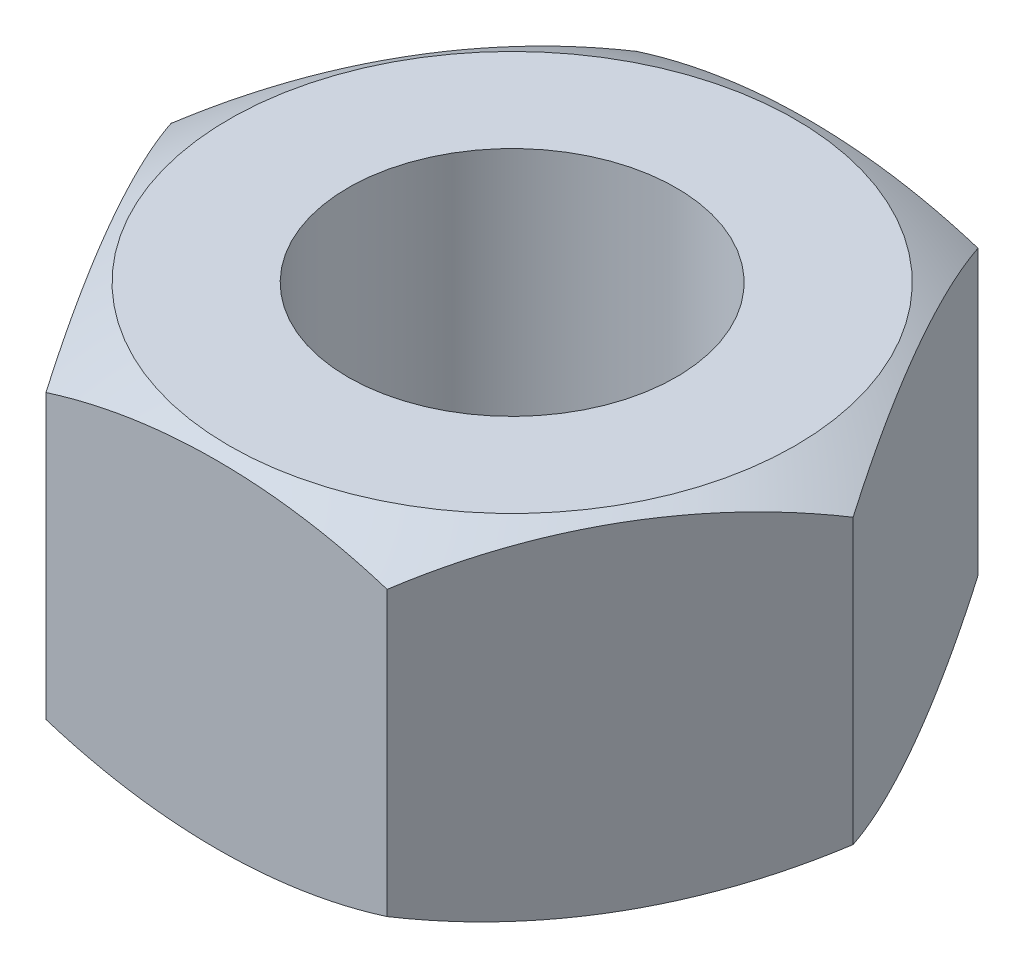
ISO-10303-21;
HEADER;
FILE_DESCRIPTION(('STEP AP214'),'2;1');
FILE_NAME('part.step','',(''),(''),'','','');
FILE_SCHEMA(('AUTOMOTIVE_DESIGN { 1 0 10303 214 1 1 1 1 }'));
ENDSEC;
DATA;
#1=APPLICATION_CONTEXT('core data for automotive mechanical design processes');
#2=APPLICATION_PROTOCOL_DEFINITION('international standard','automotive_design',2000,#1);
#3=PRODUCT_CONTEXT('',#1,'mechanical');
#4=PRODUCT('Part','Part','',(#3));
#5=PRODUCT_RELATED_PRODUCT_CATEGORY('part','',(#4));
#6=PRODUCT_DEFINITION_FORMATION('','',#4);
#7=PRODUCT_DEFINITION_CONTEXT('part definition',#1,'design');
#8=PRODUCT_DEFINITION('design','',#6,#7);
#9=PRODUCT_DEFINITION_SHAPE('','',#8);
#10=(LENGTH_UNIT() NAMED_UNIT(*) SI_UNIT(.MILLI.,.METRE.));
#11=(NAMED_UNIT(*) PLANE_ANGLE_UNIT() SI_UNIT($,.RADIAN.));
#12=(NAMED_UNIT(*) SI_UNIT($,.STERADIAN.) SOLID_ANGLE_UNIT());
#13=UNCERTAINTY_MEASURE_WITH_UNIT(LENGTH_MEASURE(1.E-05),#10,'distance_accuracy_value','');
#14=(GEOMETRIC_REPRESENTATION_CONTEXT(3) GLOBAL_UNCERTAINTY_ASSIGNED_CONTEXT((#13)) GLOBAL_UNIT_ASSIGNED_CONTEXT((#10,
#11,#12)) REPRESENTATION_CONTEXT('',''));
#15=CARTESIAN_POINT('',(0.,0.,0.));
#16=DIRECTION('',(0.,0.,1.));
#17=DIRECTION('',(1.,0.,0.));
#18=AXIS2_PLACEMENT_3D('',#15,#16,#17);
#19=CARTESIAN_POINT('',(-8.25989049367484,8.4455,-14.29385));
#20=DIRECTION('',(0.,0.,-1.));
#21=DIRECTION('',(-1.,0.,0.));
#22=AXIS2_PLACEMENT_3D('',#19,#20,#21);
#23=PLANE('',#22);
#24=DIRECTION('',(0.,-1.,0.));
#25=VECTOR('',#24,1.);
#26=CARTESIAN_POINT('',(8.2452257968374,8.4455,-14.29385));
#27=LINE('',#26,#25);
#28=CARTESIAN_POINT('',(8.2452257968374,6.85800000000003,-14.29385));
#29=VERTEX_POINT('',#28);
#30=CARTESIAN_POINT('',(8.2452257968374,-6.85800000000003,-14.29385));
#31=VERTEX_POINT('',#30);
#32=EDGE_CURVE('E252',#29,#31,#27,.T.);
#33=ORIENTED_EDGE('',*,*,#32,.T.);
#34=DIRECTION('',(-1.,0.,0.));
#35=VECTOR('',#34,1.);
#36=CARTESIAN_POINT('',(-8.25989049367482,-6.85800000000003,-14.29385));
#37=LINE('',#36,#35);
#38=CARTESIAN_POINT('',(8.23788365889581,-6.85800000000003,-14.29385));
#39=VERTEX_POINT('',#38);
#40=EDGE_CURVE('E59',#31,#39,#37,.T.);
#41=ORIENTED_EDGE('',*,*,#40,.T.);
#42=CARTESIAN_POINT('',(0.,19.05,-14.29385));
#43=DIRECTION('',(0.,0.,-1.));
#44=DIRECTION('',(-1.,0.,0.));
#45=AXIS2_PLACEMENT_3D('',#42,#43,#44);
#46=CIRCLE('',#45,27.186158080492);
#47=CARTESIAN_POINT('',(-8.23788365889583,-6.85800000000003,-14.29385));
#48=VERTEX_POINT('',#47);
#49=EDGE_CURVE('E203',#48,#39,#46,.F.);
#50=ORIENTED_EDGE('',*,*,#49,.F.);
#51=CARTESIAN_POINT('',(-8.25989049367483,-6.85800000000003,-14.29385));
#52=VERTEX_POINT('',#51);
#53=EDGE_CURVE('E197',#48,#52,#37,.T.);
#54=ORIENTED_EDGE('',*,*,#53,.T.);
#55=DIRECTION('',(0.,-1.,0.));
#56=VECTOR('',#55,1.);
#57=CARTESIAN_POINT('',(-8.25989049367484,8.4455,-14.29385));
#58=LINE('',#57,#56);
#59=CARTESIAN_POINT('',(-8.25989049367484,6.85800000000003,-14.29385));
#60=VERTEX_POINT('',#59);
#61=EDGE_CURVE('E255',#60,#52,#58,.T.);
#62=ORIENTED_EDGE('',*,*,#61,.F.);
#63=DIRECTION('',(1.,0.,0.));
#64=VECTOR('',#63,1.);
#65=CARTESIAN_POINT('',(-8.25989049367484,6.85800000000003,-14.29385));
#66=LINE('',#65,#64);
#67=CARTESIAN_POINT('',(-8.23788365889583,6.85800000000003,-14.29385));
#68=VERTEX_POINT('',#67);
#69=EDGE_CURVE('E219',#60,#68,#66,.T.);
#70=ORIENTED_EDGE('',*,*,#69,.T.);
#71=CARTESIAN_POINT('',(0.,-19.05,-14.29385));
#72=DIRECTION('',(0.,0.,-1.));
#73=DIRECTION('',(-1.,0.,0.));
#74=AXIS2_PLACEMENT_3D('',#71,#72,#73);
#75=CIRCLE('',#74,27.186158080492);
#76=CARTESIAN_POINT('',(8.2378836588958,6.85800000000003,-14.29385));
#77=VERTEX_POINT('',#76);
#78=EDGE_CURVE('E231',#77,#68,#75,.F.);
#79=ORIENTED_EDGE('',*,*,#78,.F.);
#80=EDGE_CURVE('E222',#77,#29,#66,.T.);
#81=ORIENTED_EDGE('',*,*,#80,.T.);
#82=EDGE_LOOP('',(#33,#41,#50,#54,#62,#70,#79,#81));
#83=FACE_BOUND('',#82,.T.);
#84=ADVANCED_FACE('F44',(#83),#23,.T.);
#85=CARTESIAN_POINT('',(-8.25989049367484,8.4455,-14.29385));
#86=DIRECTION('',(0.866025403784437,0.,0.500000000000005));
#87=DIRECTION('',(0.500000000000003,0.,-0.866025403784438));
#88=AXIS2_PLACEMENT_3D('',#85,#86,#87);
#89=PLANE('',#88);
#90=DIRECTION('',(0.500000000000003,0.,-0.866025403784438));
#91=VECTOR('',#90,1.);
#92=CARTESIAN_POINT('',(-8.25989049367482,-6.85800000000003,-14.29385));
#93=LINE('',#92,#91);
#94=CARTESIAN_POINT('',(-16.512448638931,-6.85800000000003,0.));
#95=VERTEX_POINT('',#94);
#96=CARTESIAN_POINT('',(-16.4977643368372,-6.85800000000003,-0.0254339573001861));
#97=VERTEX_POINT('',#96);
#98=EDGE_CURVE('E177',#95,#97,#93,.T.);
#99=ORIENTED_EDGE('',*,*,#98,.F.);
#100=DIRECTION('',(0.,-1.,0.));
#101=VECTOR('',#100,1.);
#102=CARTESIAN_POINT('',(-16.512448638931,8.4455,0.));
#103=LINE('',#102,#101);
#104=CARTESIAN_POINT('',(-16.512448638931,6.85800000000003,0.));
#105=VERTEX_POINT('',#104);
#106=EDGE_CURVE('E184',#105,#95,#103,.T.);
#107=ORIENTED_EDGE('',*,*,#106,.F.);
#108=DIRECTION('',(-0.500000000000003,0.,0.866025403784438));
#109=VECTOR('',#108,1.);
#110=CARTESIAN_POINT('',(-8.25989049367484,6.85800000000003,-14.29385));
#111=LINE('',#110,#109);
#112=CARTESIAN_POINT('',(-16.4977643368372,6.85800000000003,-0.0254339573001904));
#113=VERTEX_POINT('',#112);
#114=EDGE_CURVE('E216',#113,#105,#111,.T.);
#115=ORIENTED_EDGE('',*,*,#114,.F.);
#116=CARTESIAN_POINT('',(-12.3843364791982,-19.05,-7.15010000000006));
#117=DIRECTION('',(0.866025403784437,0.,0.500000000000005));
#118=DIRECTION('',(0.500000000000003,0.,-0.866025403784438));
#119=AXIS2_PLACEMENT_3D('',#116,#117,#118);
#120=CIRCLE('',#119,27.1828184513674);
#121=CARTESIAN_POINT('',(-8.27090862155921,6.85800000000003,-14.2747660427));
#122=VERTEX_POINT('',#121);
#123=EDGE_CURVE('E228',#113,#122,#120,.F.);
#124=ORIENTED_EDGE('',*,*,#123,.T.);
#125=EDGE_CURVE('E218',#60,#122,#111,.T.);
#126=ORIENTED_EDGE('',*,*,#125,.F.);
#127=ORIENTED_EDGE('',*,*,#61,.T.);
#128=CARTESIAN_POINT('',(-8.2709086215592,-6.85800000000003,-14.2747660427));
#129=VERTEX_POINT('',#128);
#130=EDGE_CURVE('E187',#129,#52,#93,.T.);
#131=ORIENTED_EDGE('',*,*,#130,.F.);
#132=CARTESIAN_POINT('',(-12.3843364791982,19.05,-7.1501000000001));
#133=DIRECTION('',(0.866025403784437,0.,0.500000000000005));
#134=DIRECTION('',(0.500000000000003,0.,-0.866025403784438));
#135=AXIS2_PLACEMENT_3D('',#132,#133,#134);
#136=CIRCLE('',#135,27.1828184513674);
#137=EDGE_CURVE('E170',#129,#97,#136,.F.);
#138=ORIENTED_EDGE('',*,*,#137,.T.);
#139=EDGE_LOOP('',(#99,#107,#115,#124,#126,#127,#131,#138));
#140=FACE_BOUND('',#139,.T.);
#141=ADVANCED_FACE('F308',(#140),#89,.F.);
#142=CARTESIAN_POINT('',(-16.512448638931,8.4455,0.));
#143=DIRECTION('',(0.866025403784436,0.,-0.500000000000005));
#144=DIRECTION('',(-0.500000000000004,0.,-0.866025403784439));
#145=AXIS2_PLACEMENT_3D('',#142,#143,#144);
#146=PLANE('',#145);
#147=DIRECTION('',(-0.500000000000004,0.,-0.866025403784439));
#148=VECTOR('',#147,1.);
#149=CARTESIAN_POINT('',(-16.512448638931,-6.85800000000003,0.));
#150=LINE('',#149,#148);
#151=CARTESIAN_POINT('',(-8.25989049367481,-6.85800000000003,14.29385));
#152=VERTEX_POINT('',#151);
#153=CARTESIAN_POINT('',(-8.27090862155917,-6.85800000000003,14.2747660427));
#154=VERTEX_POINT('',#153);
#155=EDGE_CURVE('E185',#152,#154,#150,.T.);
#156=ORIENTED_EDGE('',*,*,#155,.F.);
#157=DIRECTION('',(0.,-1.,0.));
#158=VECTOR('',#157,1.);
#159=CARTESIAN_POINT('',(-8.25989049367482,8.4455,14.29385));
#160=LINE('',#159,#158);
#161=CARTESIAN_POINT('',(-8.25989049367482,6.85800000000003,14.29385));
#162=VERTEX_POINT('',#161);
#163=EDGE_CURVE('E259',#162,#152,#160,.T.);
#164=ORIENTED_EDGE('',*,*,#163,.F.);
#165=DIRECTION('',(0.500000000000004,0.,0.866025403784439));
#166=VECTOR('',#165,1.);
#167=CARTESIAN_POINT('',(-16.512448638931,6.85800000000003,0.));
#168=LINE('',#167,#166);
#169=CARTESIAN_POINT('',(-8.27090862155917,6.85800000000003,14.2747660426999));
#170=VERTEX_POINT('',#169);
#171=EDGE_CURVE('E213',#170,#162,#168,.T.);
#172=ORIENTED_EDGE('',*,*,#171,.F.);
#173=CARTESIAN_POINT('',(-12.3843364791982,-19.05,7.15010000000009));
#174=DIRECTION('',(0.866025403784436,0.,-0.500000000000005));
#175=DIRECTION('',(-0.500000000000004,0.,-0.866025403784439));
#176=AXIS2_PLACEMENT_3D('',#173,#174,#175);
#177=CIRCLE('',#176,27.1828184513674);
#178=CARTESIAN_POINT('',(-16.4977643368372,6.85800000000003,0.0254339573001482));
#179=VERTEX_POINT('',#178);
#180=EDGE_CURVE('E225',#170,#179,#177,.F.);
#181=ORIENTED_EDGE('',*,*,#180,.T.);
#182=EDGE_CURVE('E215',#105,#179,#168,.T.);
#183=ORIENTED_EDGE('',*,*,#182,.F.);
#184=ORIENTED_EDGE('',*,*,#106,.T.);
#185=CARTESIAN_POINT('',(-16.4977643368372,-6.85800000000003,0.0254339573001595));
#186=VERTEX_POINT('',#185);
#187=EDGE_CURVE('E175',#186,#95,#150,.T.);
#188=ORIENTED_EDGE('',*,*,#187,.F.);
#189=CARTESIAN_POINT('',(-12.3843364791982,19.05,7.15010000000005));
#190=DIRECTION('',(0.866025403784436,0.,-0.500000000000005));
#191=DIRECTION('',(-0.500000000000004,0.,-0.866025403784439));
#192=AXIS2_PLACEMENT_3D('',#189,#190,#191);
#193=CIRCLE('',#192,27.1828184513674);
#194=EDGE_CURVE('E159',#186,#154,#193,.F.);
#195=ORIENTED_EDGE('',*,*,#194,.T.);
#196=EDGE_LOOP('',(#156,#164,#172,#181,#183,#184,#188,#195));
#197=FACE_BOUND('',#196,.T.);
#198=ADVANCED_FACE('F181',(#197),#146,.F.);
#199=CARTESIAN_POINT('',(-8.25989049367482,8.4455,14.29385));
#200=DIRECTION('',(0.,0.,-1.));
#201=DIRECTION('',(-1.,0.,0.));
#202=AXIS2_PLACEMENT_3D('',#199,#200,#201);
#203=PLANE('',#202);
#204=DIRECTION('',(-1.,0.,0.));
#205=VECTOR('',#204,1.);
#206=CARTESIAN_POINT('',(-8.25989049367481,-6.85800000000003,14.29385));
#207=LINE('',#206,#205);
#208=CARTESIAN_POINT('',(8.24522579683743,-6.85800000000003,14.29385));
#209=VERTEX_POINT('',#208);
#210=CARTESIAN_POINT('',(8.23788365889584,-6.85800000000003,14.29385));
#211=VERTEX_POINT('',#210);
#212=EDGE_CURVE('E191',#209,#211,#207,.T.);
#213=ORIENTED_EDGE('',*,*,#212,.F.);
#214=DIRECTION('',(0.,-1.,0.));
#215=VECTOR('',#214,1.);
#216=CARTESIAN_POINT('',(8.24522579683743,8.4455,14.29385));
#217=LINE('',#216,#215);
#218=CARTESIAN_POINT('',(8.24522579683741,6.85800000000003,14.29385));
#219=VERTEX_POINT('',#218);
#220=EDGE_CURVE('E247',#219,#209,#217,.T.);
#221=ORIENTED_EDGE('',*,*,#220,.F.);
#222=DIRECTION('',(1.,0.,0.));
#223=VECTOR('',#222,1.);
#224=CARTESIAN_POINT('',(-8.25989049367482,6.85800000000003,14.29385));
#225=LINE('',#224,#223);
#226=CARTESIAN_POINT('',(8.23788365889582,6.85800000000003,14.29385));
#227=VERTEX_POINT('',#226);
#228=EDGE_CURVE('E251',#227,#219,#225,.T.);
#229=ORIENTED_EDGE('',*,*,#228,.F.);
#230=CARTESIAN_POINT('',(0.,-19.05,14.29385));
#231=DIRECTION('',(0.,0.,-1.));
#232=DIRECTION('',(-1.,0.,0.));
#233=AXIS2_PLACEMENT_3D('',#230,#231,#232);
#234=CIRCLE('',#233,27.186158080492);
#235=CARTESIAN_POINT('',(-8.23788365889583,6.85800000000003,14.29385));
#236=VERTEX_POINT('',#235);
#237=EDGE_CURVE('E265',#227,#236,#234,.F.);
#238=ORIENTED_EDGE('',*,*,#237,.T.);
#239=EDGE_CURVE('E266',#162,#236,#225,.T.);
#240=ORIENTED_EDGE('',*,*,#239,.F.);
#241=ORIENTED_EDGE('',*,*,#163,.T.);
#242=CARTESIAN_POINT('',(-8.23788365889582,-6.85800000000003,14.29385));
#243=VERTEX_POINT('',#242);
#244=EDGE_CURVE('E189',#243,#152,#207,.T.);
#245=ORIENTED_EDGE('',*,*,#244,.F.);
#246=CARTESIAN_POINT('',(0.,19.05,14.2938499999999));
#247=DIRECTION('',(0.,0.,-1.));
#248=DIRECTION('',(-1.,0.,0.));
#249=AXIS2_PLACEMENT_3D('',#246,#247,#248);
#250=CIRCLE('',#249,27.186158080492);
#251=EDGE_CURVE('E171',#243,#211,#250,.F.);
#252=ORIENTED_EDGE('',*,*,#251,.T.);
#253=EDGE_LOOP('',(#213,#221,#229,#238,#240,#241,#245,#252));
#254=FACE_BOUND('',#253,.T.);
#255=ADVANCED_FACE('F281',(#254),#203,.F.);
#256=CARTESIAN_POINT('',(-0.00733234841868469,8.4455,28.5876999999998));
#257=DIRECTION('',(0.,1.,0.));
#258=DIRECTION('',(0.,0.,1.));
#259=AXIS2_PLACEMENT_3D('',#256,#257,#258);
#260=PLANE('',#259);
#261=CARTESIAN_POINT('',(0.,8.4455,0.));
#262=DIRECTION('',(0.,1.,0.));
#263=DIRECTION('',(0.,0.,1.));
#264=AXIS2_PLACEMENT_3D('',#261,#262,#263);
#265=CIRCLE('',#264,13.6893688221919);
#266=CARTESIAN_POINT('',(0.,8.44549999999998,13.689368822192));
#267=VERTEX_POINT('',#266);
#268=EDGE_CURVE('E238',#267,#267,#265,.F.);
#269=ORIENTED_EDGE('',*,*,#268,.F.);
#270=EDGE_LOOP('',(#269));
#271=FACE_BOUND('',#270,.T.);
#272=CARTESIAN_POINT('',(0.,8.4455,0.));
#273=DIRECTION('',(0.,1.,0.));
#274=DIRECTION('',(0.,0.,1.));
#275=AXIS2_PLACEMENT_3D('',#272,#273,#274);
#276=CIRCLE('',#275,7.9375);
#277=CARTESIAN_POINT('',(0.,8.44549999999999,7.93750000000001));
#278=VERTEX_POINT('',#277);
#279=EDGE_CURVE('E244',#278,#278,#276,.T.);
#280=ORIENTED_EDGE('',*,*,#279,.F.);
#281=EDGE_LOOP('',(#280));
#282=FACE_BOUND('',#281,.T.);
#283=ADVANCED_FACE('F350',(#271,#282),#260,.T.);
#284=CARTESIAN_POINT('',(-0.00733234841868989,-8.4455,28.5876999999999));
#285=DIRECTION('',(0.,1.,0.));
#286=DIRECTION('',(0.,0.,1.));
#287=AXIS2_PLACEMENT_3D('',#284,#285,#286);
#288=PLANE('',#287);
#289=CARTESIAN_POINT('',(0.,-8.4455,0.));
#290=DIRECTION('',(0.,1.,0.));
#291=DIRECTION('',(0.,0.,1.));
#292=AXIS2_PLACEMENT_3D('',#289,#290,#291);
#293=CIRCLE('',#292,13.6893688221919);
#294=CARTESIAN_POINT('',(0.,-8.44550000000001,13.689368822192));
#295=VERTEX_POINT('',#294);
#296=EDGE_CURVE('E196',#295,#295,#293,.F.);
#297=ORIENTED_EDGE('',*,*,#296,.T.);
#298=EDGE_LOOP('',(#297));
#299=FACE_BOUND('',#298,.T.);
#300=CARTESIAN_POINT('',(0.,-8.4455,0.));
#301=DIRECTION('',(0.,1.,0.));
#302=DIRECTION('',(0.,0.,1.));
#303=AXIS2_PLACEMENT_3D('',#300,#301,#302);
#304=CIRCLE('',#303,7.9375);
#305=CARTESIAN_POINT('',(0.,-8.4455,7.93750000000003));
#306=VERTEX_POINT('',#305);
#307=EDGE_CURVE('E241',#306,#306,#304,.T.);
#308=ORIENTED_EDGE('',*,*,#307,.T.);
#309=EDGE_LOOP('',(#308));
#310=FACE_BOUND('',#309,.T.);
#311=ADVANCED_FACE('F354',(#299,#310),#288,.F.);
#312=CARTESIAN_POINT('',(16.4977839420936,8.4455,0.));
#313=DIRECTION('',(0.866025403784437,0.,0.500000000000006));
#314=DIRECTION('',(0.500000000000003,0.,-0.866025403784438));
#315=AXIS2_PLACEMENT_3D('',#312,#313,#314);
#316=PLANE('',#315);
#317=CARTESIAN_POINT('',(12.3733379565701,19.05,7.14375000000006));
#318=DIRECTION('',(0.866025403784437,0.,0.500000000000006));
#319=DIRECTION('',(0.500000000000003,0.,-0.866025403784438));
#320=AXIS2_PLACEMENT_3D('',#317,#318,#319);
#321=CIRCLE('',#320,27.1894958163994);
#322=CARTESIAN_POINT('',(16.4977839420936,-6.85800000000003,0.));
#323=VERTEX_POINT('',#322);
#324=CARTESIAN_POINT('',(8.2488919710467,-6.85800000000003,14.2875000000001));
#325=VERTEX_POINT('',#324);
#326=EDGE_CURVE('E194',#323,#325,#321,.F.);
#327=ORIENTED_EDGE('',*,*,#326,.F.);
#328=DIRECTION('',(0.,-1.,0.));
#329=VECTOR('',#328,1.);
#330=CARTESIAN_POINT('',(16.4977839420936,8.4455,0.));
#331=LINE('',#330,#329);
#332=CARTESIAN_POINT('',(16.4977839420936,6.85800000000003,0.));
#333=VERTEX_POINT('',#332);
#334=EDGE_CURVE('E248',#333,#323,#331,.T.);
#335=ORIENTED_EDGE('',*,*,#334,.F.);
#336=CARTESIAN_POINT('',(12.3733379565701,-19.05,7.14375000000009));
#337=DIRECTION('',(0.866025403784437,0.,0.500000000000006));
#338=DIRECTION('',(0.500000000000003,0.,-0.866025403784438));
#339=AXIS2_PLACEMENT_3D('',#336,#337,#338);
#340=CIRCLE('',#339,27.1894958163994);
#341=CARTESIAN_POINT('',(8.24889197104668,6.85800000000003,14.2875000000001));
#342=VERTEX_POINT('',#341);
#343=EDGE_CURVE('E236',#342,#333,#340,.F.);
#344=ORIENTED_EDGE('',*,*,#343,.F.);
#345=DIRECTION('',(-0.500000000000003,0.,0.866025403784438));
#346=VECTOR('',#345,1.);
#347=CARTESIAN_POINT('',(16.4977839420936,6.85800000000003,0.));
#348=LINE('',#347,#346);
#349=EDGE_CURVE('E210',#342,#219,#348,.T.);
#350=ORIENTED_EDGE('',*,*,#349,.T.);
#351=ORIENTED_EDGE('',*,*,#220,.T.);
#352=DIRECTION('',(0.500000000000003,0.,-0.866025403784438));
#353=VECTOR('',#352,1.);
#354=CARTESIAN_POINT('',(16.4977839420936,-6.85800000000003,0.));
#355=LINE('',#354,#353);
#356=EDGE_CURVE('E317',#209,#325,#355,.T.);
#357=ORIENTED_EDGE('',*,*,#356,.T.);
#358=EDGE_LOOP('',(#327,#335,#344,#350,#351,#357));
#359=FACE_BOUND('',#358,.T.);
#360=ADVANCED_FACE('F46',(#359),#316,.T.);
#361=CARTESIAN_POINT('',(16.4977839420936,8.4455,0.));
#362=DIRECTION('',(-0.866025403784436,0.,0.500000000000004));
#363=DIRECTION('',(0.500000000000004,0.,0.866025403784439));
#364=AXIS2_PLACEMENT_3D('',#361,#362,#363);
#365=PLANE('',#364);
#366=ORIENTED_EDGE('',*,*,#334,.T.);
#367=CARTESIAN_POINT('',(12.3733379565701,19.05,-7.14375000000008));
#368=DIRECTION('',(-0.866025403784436,0.,0.500000000000004));
#369=DIRECTION('',(0.500000000000004,0.,0.866025403784439));
#370=AXIS2_PLACEMENT_3D('',#367,#368,#369);
#371=CIRCLE('',#370,27.1894958163994);
#372=CARTESIAN_POINT('',(8.24889197104667,-6.85800000000003,-14.2875000000001));
#373=VERTEX_POINT('',#372);
#374=EDGE_CURVE('E13',#323,#373,#371,.F.);
#375=ORIENTED_EDGE('',*,*,#374,.T.);
#376=DIRECTION('',(0.500000000000004,0.,0.866025403784439));
#377=VECTOR('',#376,1.);
#378=CARTESIAN_POINT('',(16.4977839420936,-6.85800000000003,0.));
#379=LINE('',#378,#377);
#380=EDGE_CURVE('E52',#31,#373,#379,.T.);
#381=ORIENTED_EDGE('',*,*,#380,.F.);
#382=ORIENTED_EDGE('',*,*,#32,.F.);
#383=DIRECTION('',(-0.500000000000004,0.,-0.866025403784439));
#384=VECTOR('',#383,1.);
#385=CARTESIAN_POINT('',(16.4977839420936,6.85800000000003,0.));
#386=LINE('',#385,#384);
#387=CARTESIAN_POINT('',(8.24889197104666,6.85800000000003,-14.2875000000001));
#388=VERTEX_POINT('',#387);
#389=EDGE_CURVE('E223',#388,#29,#386,.T.);
#390=ORIENTED_EDGE('',*,*,#389,.F.);
#391=CARTESIAN_POINT('',(12.3733379565701,-19.05,-7.14375000000004));
#392=DIRECTION('',(-0.866025403784436,0.,0.500000000000004));
#393=DIRECTION('',(0.500000000000004,0.,0.866025403784439));
#394=AXIS2_PLACEMENT_3D('',#391,#392,#393);
#395=CIRCLE('',#394,27.1894958163994);
#396=EDGE_CURVE('E233',#388,#333,#395,.F.);
#397=ORIENTED_EDGE('',*,*,#396,.T.);
#398=EDGE_LOOP('',(#366,#375,#381,#382,#390,#397));
#399=FACE_BOUND('',#398,.T.);
#400=ADVANCED_FACE('F293',(#399),#365,.F.);
#401=CARTESIAN_POINT('',(0.,8.4455,0.));
#402=DIRECTION('',(0.,-1.,0.));
#403=DIRECTION('',(0.,0.,-1.));
#404=AXIS2_PLACEMENT_3D('',#401,#402,#403);
#405=CYLINDRICAL_SURFACE('',#404,7.9375);
#406=ORIENTED_EDGE('',*,*,#279,.T.);
#407=EDGE_LOOP('',(#406));
#408=FACE_BOUND('',#407,.T.);
#409=ORIENTED_EDGE('',*,*,#307,.F.);
#410=EDGE_LOOP('',(#409));
#411=FACE_BOUND('',#410,.T.);
#412=ADVANCED_FACE('F364',(#408,#411),#405,.F.);
#413=CARTESIAN_POINT('',(0.,-19.05,0.));
#414=DIRECTION('',(0.,1.,0.));
#415=DIRECTION('',(1.,0.,0.));
#416=AXIS2_PLACEMENT_3D('',#413,#414,#415);
#417=SPHERICAL_SURFACE('',#416,30.7148390684373);
#418=ORIENTED_EDGE('',*,*,#268,.T.);
#419=EDGE_LOOP('',(#418));
#420=FACE_BOUND('',#419,.T.);
#421=ORIENTED_EDGE('',*,*,#343,.T.);
#422=ORIENTED_EDGE('',*,*,#396,.F.);
#423=CARTESIAN_POINT('',(0.,6.85800000000003,0.));
#424=DIRECTION('',(0.,1.,0.));
#425=DIRECTION('',(-1.,0.,0.));
#426=AXIS2_PLACEMENT_3D('',#423,#424,#425);
#427=CIRCLE('',#426,16.4977839420936);
#428=EDGE_CURVE('E298',#388,#77,#427,.T.);
#429=ORIENTED_EDGE('',*,*,#428,.T.);
#430=ORIENTED_EDGE('',*,*,#78,.T.);
#431=EDGE_CURVE('E208',#68,#122,#427,.T.);
#432=ORIENTED_EDGE('',*,*,#431,.T.);
#433=ORIENTED_EDGE('',*,*,#123,.F.);
#434=EDGE_CURVE('E205',#113,#179,#427,.T.);
#435=ORIENTED_EDGE('',*,*,#434,.T.);
#436=ORIENTED_EDGE('',*,*,#180,.F.);
#437=EDGE_CURVE('E209',#170,#236,#427,.T.);
#438=ORIENTED_EDGE('',*,*,#437,.T.);
#439=ORIENTED_EDGE('',*,*,#237,.F.);
#440=EDGE_CURVE('E67',#227,#342,#427,.T.);
#441=ORIENTED_EDGE('',*,*,#440,.T.);
#442=EDGE_LOOP('',(#421,#422,#429,#430,#432,#433,#435,#436,#438,#439,#441));
#443=FACE_BOUND('',#442,.T.);
#444=ADVANCED_FACE('F278',(#420,#443),#417,.T.);
#445=CARTESIAN_POINT('',(16.4977839420936,6.85800000000003,0.));
#446=DIRECTION('',(0.,1.,0.));
#447=DIRECTION('',(-1.,0.,0.));
#448=AXIS2_PLACEMENT_3D('',#445,#446,#447);
#449=PLANE('',#448);
#450=ORIENTED_EDGE('',*,*,#389,.T.);
#451=ORIENTED_EDGE('',*,*,#80,.F.);
#452=ORIENTED_EDGE('',*,*,#428,.F.);
#453=EDGE_LOOP('',(#450,#451,#452));
#454=FACE_BOUND('',#453,.T.);
#455=ADVANCED_FACE('F297',(#454),#449,.T.);
#456=ORIENTED_EDGE('',*,*,#114,.T.);
#457=ORIENTED_EDGE('',*,*,#182,.T.);
#458=ORIENTED_EDGE('',*,*,#434,.F.);
#459=EDGE_LOOP('',(#456,#457,#458));
#460=FACE_BOUND('',#459,.T.);
#461=ADVANCED_FACE('F328',(#460),#449,.T.);
#462=ORIENTED_EDGE('',*,*,#171,.T.);
#463=ORIENTED_EDGE('',*,*,#239,.T.);
#464=ORIENTED_EDGE('',*,*,#437,.F.);
#465=EDGE_LOOP('',(#462,#463,#464));
#466=FACE_BOUND('',#465,.T.);
#467=ADVANCED_FACE('F273',(#466),#449,.T.);
#468=ORIENTED_EDGE('',*,*,#125,.T.);
#469=ORIENTED_EDGE('',*,*,#431,.F.);
#470=ORIENTED_EDGE('',*,*,#69,.F.);
#471=EDGE_LOOP('',(#468,#469,#470));
#472=FACE_BOUND('',#471,.T.);
#473=ADVANCED_FACE('F305',(#472),#449,.T.);
#474=ORIENTED_EDGE('',*,*,#440,.F.);
#475=ORIENTED_EDGE('',*,*,#228,.T.);
#476=ORIENTED_EDGE('',*,*,#349,.F.);
#477=EDGE_LOOP('',(#474,#475,#476));
#478=FACE_BOUND('',#477,.T.);
#479=ADVANCED_FACE('F283',(#478),#449,.T.);
#480=CARTESIAN_POINT('',(0.,19.05,0.));
#481=DIRECTION('',(0.,-1.,0.));
#482=DIRECTION('',(1.,0.,0.));
#483=AXIS2_PLACEMENT_3D('',#480,#481,#482);
#484=SPHERICAL_SURFACE('',#483,30.7148390684373);
#485=ORIENTED_EDGE('',*,*,#49,.T.);
#486=CARTESIAN_POINT('',(0.,-6.85800000000003,0.));
#487=DIRECTION('',(0.,1.,0.));
#488=DIRECTION('',(-1.,0.,0.));
#489=AXIS2_PLACEMENT_3D('',#486,#487,#488);
#490=CIRCLE('',#489,16.4977839420936);
#491=EDGE_CURVE('E322',#373,#39,#490,.T.);
#492=ORIENTED_EDGE('',*,*,#491,.F.);
#493=ORIENTED_EDGE('',*,*,#374,.F.);
#494=ORIENTED_EDGE('',*,*,#326,.T.);
#495=EDGE_CURVE('E318',#211,#325,#490,.T.);
#496=ORIENTED_EDGE('',*,*,#495,.F.);
#497=ORIENTED_EDGE('',*,*,#251,.F.);
#498=EDGE_CURVE('E166',#154,#243,#490,.T.);
#499=ORIENTED_EDGE('',*,*,#498,.F.);
#500=ORIENTED_EDGE('',*,*,#194,.F.);
#501=EDGE_CURVE('E163',#97,#186,#490,.T.);
#502=ORIENTED_EDGE('',*,*,#501,.F.);
#503=ORIENTED_EDGE('',*,*,#137,.F.);
#504=EDGE_CURVE('E178',#48,#129,#490,.T.);
#505=ORIENTED_EDGE('',*,*,#504,.F.);
#506=EDGE_LOOP('',(#485,#492,#493,#494,#496,#497,#499,#500,#502,#503,#505));
#507=FACE_BOUND('',#506,.T.);
#508=ORIENTED_EDGE('',*,*,#296,.F.);
#509=EDGE_LOOP('',(#508));
#510=FACE_BOUND('',#509,.T.);
#511=ADVANCED_FACE('F161',(#507,#510),#484,.T.);
#512=CARTESIAN_POINT('',(16.4977839420936,-6.85800000000003,0.));
#513=DIRECTION('',(0.,-1.,0.));
#514=DIRECTION('',(-1.,0.,0.));
#515=AXIS2_PLACEMENT_3D('',#512,#513,#514);
#516=PLANE('',#515);
#517=ORIENTED_EDGE('',*,*,#98,.T.);
#518=ORIENTED_EDGE('',*,*,#501,.T.);
#519=ORIENTED_EDGE('',*,*,#187,.T.);
#520=EDGE_LOOP('',(#517,#518,#519));
#521=FACE_BOUND('',#520,.T.);
#522=ADVANCED_FACE('F174',(#521),#516,.T.);
#523=ORIENTED_EDGE('',*,*,#155,.T.);
#524=ORIENTED_EDGE('',*,*,#498,.T.);
#525=ORIENTED_EDGE('',*,*,#244,.T.);
#526=EDGE_LOOP('',(#523,#524,#525));
#527=FACE_BOUND('',#526,.T.);
#528=ADVANCED_FACE('F331',(#527),#516,.T.);
#529=ORIENTED_EDGE('',*,*,#212,.T.);
#530=ORIENTED_EDGE('',*,*,#495,.T.);
#531=ORIENTED_EDGE('',*,*,#356,.F.);
#532=EDGE_LOOP('',(#529,#530,#531));
#533=FACE_BOUND('',#532,.T.);
#534=ADVANCED_FACE('F329',(#533),#516,.T.);
#535=ORIENTED_EDGE('',*,*,#504,.T.);
#536=ORIENTED_EDGE('',*,*,#130,.T.);
#537=ORIENTED_EDGE('',*,*,#53,.F.);
#538=EDGE_LOOP('',(#535,#536,#537));
#539=FACE_BOUND('',#538,.T.);
#540=ADVANCED_FACE('F325',(#539),#516,.T.);
#541=ORIENTED_EDGE('',*,*,#380,.T.);
#542=ORIENTED_EDGE('',*,*,#491,.T.);
#543=ORIENTED_EDGE('',*,*,#40,.F.);
#544=EDGE_LOOP('',(#541,#542,#543));
#545=FACE_BOUND('',#544,.T.);
#546=ADVANCED_FACE('F337',(#545),#516,.T.);
#547=CLOSED_SHELL('',(#84,#141,#198,#255,#283,#311,#360,#400,#412,#444,#455,#461,#467,#473,#479,
#511,#522,#528,#534,#540,#546));
#548=MANIFOLD_SOLID_BREP('B2',#547);
#549=ADVANCED_BREP_SHAPE_REPRESENTATION('',(#18,#548),#14);
#550=SHAPE_DEFINITION_REPRESENTATION(#9,#549);
ENDSEC;
END-ISO-10303-21;
